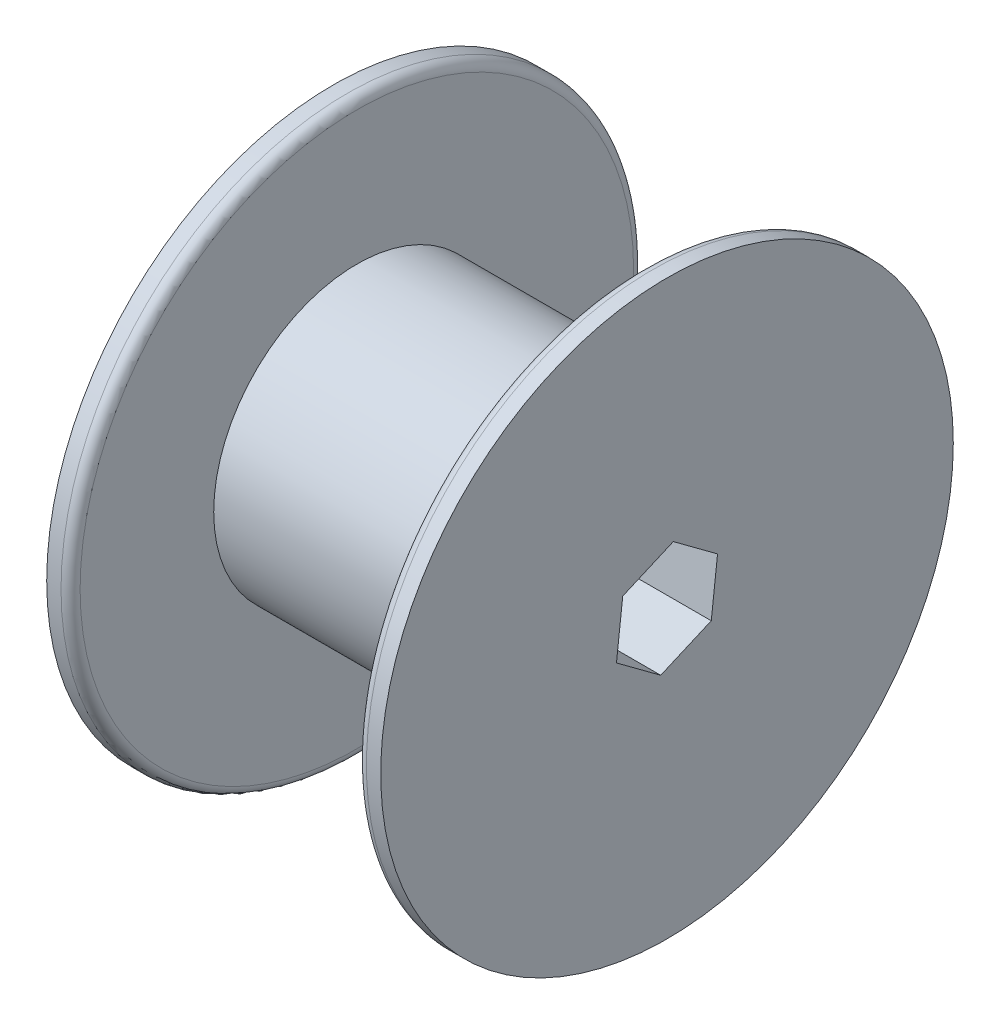
ISO-10303-21;
HEADER;
FILE_DESCRIPTION(('STEP AP214'),'2;1');
FILE_NAME('part.step','',(''),(''),'','','');
FILE_SCHEMA(('AUTOMOTIVE_DESIGN { 1 0 10303 214 1 1 1 1 }'));
ENDSEC;
DATA;
#1=APPLICATION_CONTEXT('core data for automotive mechanical design processes');
#2=APPLICATION_PROTOCOL_DEFINITION('international standard','automotive_design',2000,#1);
#3=PRODUCT_CONTEXT('',#1,'mechanical');
#4=PRODUCT('Part','Part','',(#3));
#5=PRODUCT_RELATED_PRODUCT_CATEGORY('part','',(#4));
#6=PRODUCT_DEFINITION_FORMATION('','',#4);
#7=PRODUCT_DEFINITION_CONTEXT('part definition',#1,'design');
#8=PRODUCT_DEFINITION('design','',#6,#7);
#9=PRODUCT_DEFINITION_SHAPE('','',#8);
#10=(LENGTH_UNIT() NAMED_UNIT(*) SI_UNIT(.MILLI.,.METRE.));
#11=(NAMED_UNIT(*) PLANE_ANGLE_UNIT() SI_UNIT($,.RADIAN.));
#12=(NAMED_UNIT(*) SI_UNIT($,.STERADIAN.) SOLID_ANGLE_UNIT());
#13=UNCERTAINTY_MEASURE_WITH_UNIT(LENGTH_MEASURE(1.E-05),#10,'distance_accuracy_value','');
#14=(GEOMETRIC_REPRESENTATION_CONTEXT(3) GLOBAL_UNCERTAINTY_ASSIGNED_CONTEXT((#13)) GLOBAL_UNIT_ASSIGNED_CONTEXT((#10,
#11,#12)) REPRESENTATION_CONTEXT('',''));
#15=CARTESIAN_POINT('',(0.,0.,0.));
#16=DIRECTION('',(0.,0.,1.));
#17=DIRECTION('',(1.,0.,0.));
#18=AXIS2_PLACEMENT_3D('',#15,#16,#17);
#19=CARTESIAN_POINT('',(38.1,0.,0.));
#20=DIRECTION('',(-1.,0.,0.));
#21=DIRECTION('',(0.,0.,1.));
#22=AXIS2_PLACEMENT_3D('',#19,#20,#21);
#23=CYLINDRICAL_SURFACE('',#22,19.05);
#24=CARTESIAN_POINT('',(38.1,0.,0.));
#25=DIRECTION('',(1.,0.,0.));
#26=DIRECTION('',(0.,0.,-1.));
#27=AXIS2_PLACEMENT_3D('',#24,#25,#26);
#28=CIRCLE('',#27,19.05);
#29=CARTESIAN_POINT('',(38.1,0.,-19.05));
#30=VERTEX_POINT('',#29);
#31=EDGE_CURVE('E188',#30,#30,#28,.T.);
#32=ORIENTED_EDGE('',*,*,#31,.F.);
#33=EDGE_LOOP('',(#32));
#34=FACE_BOUND('',#33,.T.);
#35=CARTESIAN_POINT('',(0.,0.,0.));
#36=DIRECTION('',(1.,0.,0.));
#37=DIRECTION('',(0.,0.,-1.));
#38=AXIS2_PLACEMENT_3D('',#35,#36,#37);
#39=CIRCLE('',#38,19.05);
#40=CARTESIAN_POINT('',(0.,0.,-19.05));
#41=VERTEX_POINT('',#40);
#42=EDGE_CURVE('E187',#41,#41,#39,.T.);
#43=ORIENTED_EDGE('',*,*,#42,.T.);
#44=EDGE_LOOP('',(#43));
#45=FACE_BOUND('',#44,.T.);
#46=ADVANCED_FACE('F38',(#34,#45),#23,.T.);
#47=CARTESIAN_POINT('',(-3.175,0.,0.));
#48=DIRECTION('',(1.,0.,0.));
#49=DIRECTION('',(0.,0.,-1.));
#50=AXIS2_PLACEMENT_3D('',#47,#48,#49);
#51=CYLINDRICAL_SURFACE('',#50,38.1);
#52=CARTESIAN_POINT('',(-1.27,0.,0.));
#53=DIRECTION('',(-1.,0.,0.));
#54=DIRECTION('',(0.,0.,1.));
#55=AXIS2_PLACEMENT_3D('',#52,#53,#54);
#56=CIRCLE('',#55,38.1);
#57=CARTESIAN_POINT('',(-1.27,0.,38.1));
#58=VERTEX_POINT('',#57);
#59=EDGE_CURVE('E192',#58,#58,#56,.T.);
#60=ORIENTED_EDGE('',*,*,#59,.T.);
#61=EDGE_LOOP('',(#60));
#62=FACE_BOUND('',#61,.T.);
#63=CARTESIAN_POINT('',(-3.175,0.,0.));
#64=DIRECTION('',(-1.,0.,0.));
#65=DIRECTION('',(0.,0.,1.));
#66=AXIS2_PLACEMENT_3D('',#63,#64,#65);
#67=CIRCLE('',#66,38.1);
#68=CARTESIAN_POINT('',(-3.175,0.,38.1));
#69=VERTEX_POINT('',#68);
#70=EDGE_CURVE('E183',#69,#69,#67,.T.);
#71=ORIENTED_EDGE('',*,*,#70,.F.);
#72=EDGE_LOOP('',(#71));
#73=FACE_BOUND('',#72,.T.);
#74=ADVANCED_FACE('F223',(#62,#73),#51,.T.);
#75=CARTESIAN_POINT('',(-3.175,0.,0.));
#76=DIRECTION('',(-1.,0.,0.));
#77=DIRECTION('',(0.,0.,1.));
#78=AXIS2_PLACEMENT_3D('',#75,#76,#77);
#79=PLANE('',#78);
#80=DIRECTION('',(0.,0.397948787548919,-0.917407631583881));
#81=VECTOR('',#80,1.);
#82=CARTESIAN_POINT('',(-3.175,4.36658887900208,5.89035099931313));
#83=LINE('',#82,#81);
#84=CARTESIAN_POINT('',(-3.175,4.36658887900208,5.89035099931313));
#85=VERTEX_POINT('',#84);
#86=CARTESIAN_POINT('',(-3.175,7.28448804211327,-0.836401397441846));
#87=VERTEX_POINT('',#86);
#88=EDGE_CURVE('E161',#85,#87,#83,.T.);
#89=ORIENTED_EDGE('',*,*,#88,.F.);
#90=DIRECTION('',(0.,0.993472708351815,-0.11407005636936));
#91=VECTOR('',#90,1.);
#92=CARTESIAN_POINT('',(-3.175,-2.9178991631112,6.72675239675497));
#93=LINE('',#92,#91);
#94=CARTESIAN_POINT('',(-3.175,-2.9178991631112,6.72675239675497));
#95=VERTEX_POINT('',#94);
#96=EDGE_CURVE('E132',#95,#85,#93,.T.);
#97=ORIENTED_EDGE('',*,*,#96,.F.);
#98=DIRECTION('',(0.,0.595523920802897,0.803337575214521));
#99=VECTOR('',#98,1.);
#100=CARTESIAN_POINT('',(-3.175,-7.28448804211327,0.836401397441842));
#101=LINE('',#100,#99);
#102=CARTESIAN_POINT('',(-3.175,-7.28448804211327,0.836401397441842));
#103=VERTEX_POINT('',#102);
#104=EDGE_CURVE('E155',#103,#95,#101,.T.);
#105=ORIENTED_EDGE('',*,*,#104,.F.);
#106=DIRECTION('',(0.,-0.397948787548919,0.917407631583881));
#107=VECTOR('',#106,1.);
#108=CARTESIAN_POINT('',(-3.175,-4.36658887900208,-5.89035099931314));
#109=LINE('',#108,#107);
#110=CARTESIAN_POINT('',(-3.175,-4.36658887900208,-5.89035099931314));
#111=VERTEX_POINT('',#110);
#112=EDGE_CURVE('E152',#111,#103,#109,.T.);
#113=ORIENTED_EDGE('',*,*,#112,.F.);
#114=DIRECTION('',(0.,-0.993472708351815,0.114070056369361));
#115=VECTOR('',#114,1.);
#116=CARTESIAN_POINT('',(-3.175,2.9178991631112,-6.72675239675498));
#117=LINE('',#116,#115);
#118=CARTESIAN_POINT('',(-3.175,2.9178991631112,-6.72675239675498));
#119=VERTEX_POINT('',#118);
#120=EDGE_CURVE('E92',#119,#111,#117,.T.);
#121=ORIENTED_EDGE('',*,*,#120,.F.);
#122=DIRECTION('',(0.,-0.595523920802897,-0.80333757521452));
#123=VECTOR('',#122,1.);
#124=CARTESIAN_POINT('',(-3.175,7.28448804211327,-0.836401397441846));
#125=LINE('',#124,#123);
#126=EDGE_CURVE('E86',#87,#119,#125,.T.);
#127=ORIENTED_EDGE('',*,*,#126,.F.);
#128=EDGE_LOOP('',(#89,#97,#105,#113,#121,#127));
#129=FACE_BOUND('',#128,.T.);
#130=ORIENTED_EDGE('',*,*,#70,.T.);
#131=EDGE_LOOP('',(#130));
#132=FACE_BOUND('',#131,.T.);
#133=ADVANCED_FACE('F229',(#129,#132),#79,.T.);
#134=CARTESIAN_POINT('',(0.,0.,0.));
#135=DIRECTION('',(-1.,0.,0.));
#136=DIRECTION('',(0.,0.,1.));
#137=AXIS2_PLACEMENT_3D('',#134,#135,#136);
#138=PLANE('',#137);
#139=CARTESIAN_POINT('',(0.,0.,0.));
#140=DIRECTION('',(-1.,0.,0.));
#141=DIRECTION('',(0.,0.,1.));
#142=AXIS2_PLACEMENT_3D('',#139,#140,#141);
#143=CIRCLE('',#142,36.83);
#144=CARTESIAN_POINT('',(0.,0.,36.83));
#145=VERTEX_POINT('',#144);
#146=EDGE_CURVE('E199',#145,#145,#143,.F.);
#147=ORIENTED_EDGE('',*,*,#146,.T.);
#148=EDGE_LOOP('',(#147));
#149=FACE_BOUND('',#148,.T.);
#150=ORIENTED_EDGE('',*,*,#42,.F.);
#151=EDGE_LOOP('',(#150));
#152=FACE_BOUND('',#151,.T.);
#153=ADVANCED_FACE('F235',(#149,#152),#138,.F.);
#154=CARTESIAN_POINT('',(41.275,0.,0.));
#155=DIRECTION('',(-1.,0.,0.));
#156=DIRECTION('',(0.,0.,1.));
#157=AXIS2_PLACEMENT_3D('',#154,#155,#156);
#158=CYLINDRICAL_SURFACE('',#157,38.1);
#159=CARTESIAN_POINT('',(39.37,0.,0.));
#160=DIRECTION('',(1.,0.,0.));
#161=DIRECTION('',(0.,0.,-1.));
#162=AXIS2_PLACEMENT_3D('',#159,#160,#161);
#163=CIRCLE('',#162,38.1);
#164=CARTESIAN_POINT('',(39.37,0.,-38.1));
#165=VERTEX_POINT('',#164);
#166=EDGE_CURVE('E48',#165,#165,#163,.T.);
#167=ORIENTED_EDGE('',*,*,#166,.T.);
#168=EDGE_LOOP('',(#167));
#169=FACE_BOUND('',#168,.T.);
#170=CARTESIAN_POINT('',(41.275,0.,0.));
#171=DIRECTION('',(1.,0.,0.));
#172=DIRECTION('',(0.,0.,-1.));
#173=AXIS2_PLACEMENT_3D('',#170,#171,#172);
#174=CIRCLE('',#173,38.1);
#175=CARTESIAN_POINT('',(41.275,0.,-38.1));
#176=VERTEX_POINT('',#175);
#177=EDGE_CURVE('E169',#176,#176,#174,.T.);
#178=ORIENTED_EDGE('',*,*,#177,.F.);
#179=EDGE_LOOP('',(#178));
#180=FACE_BOUND('',#179,.T.);
#181=ADVANCED_FACE('F206',(#169,#180),#158,.T.);
#182=CARTESIAN_POINT('',(41.275,0.,0.));
#183=DIRECTION('',(1.,0.,0.));
#184=DIRECTION('',(0.,0.,-1.));
#185=AXIS2_PLACEMENT_3D('',#182,#183,#184);
#186=PLANE('',#185);
#187=DIRECTION('',(0.,-0.993472708351815,0.114070056369361));
#188=VECTOR('',#187,1.);
#189=CARTESIAN_POINT('',(41.275,2.9178991631112,-6.72675239675498));
#190=LINE('',#189,#188);
#191=CARTESIAN_POINT('',(41.275,2.9178991631112,-6.72675239675498));
#192=VERTEX_POINT('',#191);
#193=CARTESIAN_POINT('',(41.275,-4.36658887900208,-5.89035099931314));
#194=VERTEX_POINT('',#193);
#195=EDGE_CURVE('E58',#192,#194,#190,.T.);
#196=ORIENTED_EDGE('',*,*,#195,.T.);
#197=DIRECTION('',(0.,-0.397948787548919,0.917407631583881));
#198=VECTOR('',#197,1.);
#199=CARTESIAN_POINT('',(41.275,-4.36658887900208,-5.89035099931314));
#200=LINE('',#199,#198);
#201=CARTESIAN_POINT('',(41.275,-7.28448804211327,0.836401397441842));
#202=VERTEX_POINT('',#201);
#203=EDGE_CURVE('E102',#194,#202,#200,.T.);
#204=ORIENTED_EDGE('',*,*,#203,.T.);
#205=DIRECTION('',(0.,0.595523920802897,0.803337575214521));
#206=VECTOR('',#205,1.);
#207=CARTESIAN_POINT('',(41.275,-7.28448804211327,0.836401397441842));
#208=LINE('',#207,#206);
#209=CARTESIAN_POINT('',(41.275,-2.9178991631112,6.72675239675497));
#210=VERTEX_POINT('',#209);
#211=EDGE_CURVE('E139',#202,#210,#208,.T.);
#212=ORIENTED_EDGE('',*,*,#211,.T.);
#213=DIRECTION('',(0.,0.993472708351815,-0.11407005636936));
#214=VECTOR('',#213,1.);
#215=CARTESIAN_POINT('',(41.275,-2.9178991631112,6.72675239675497));
#216=LINE('',#215,#214);
#217=CARTESIAN_POINT('',(41.275,4.36658887900208,5.89035099931313));
#218=VERTEX_POINT('',#217);
#219=EDGE_CURVE('E125',#210,#218,#216,.T.);
#220=ORIENTED_EDGE('',*,*,#219,.T.);
#221=DIRECTION('',(0.,0.397948787548919,-0.917407631583881));
#222=VECTOR('',#221,1.);
#223=CARTESIAN_POINT('',(41.275,4.36658887900208,5.89035099931313));
#224=LINE('',#223,#222);
#225=CARTESIAN_POINT('',(41.275,7.28448804211327,-0.836401397441846));
#226=VERTEX_POINT('',#225);
#227=EDGE_CURVE('E114',#218,#226,#224,.T.);
#228=ORIENTED_EDGE('',*,*,#227,.T.);
#229=DIRECTION('',(0.,-0.595523920802897,-0.80333757521452));
#230=VECTOR('',#229,1.);
#231=CARTESIAN_POINT('',(41.275,7.28448804211327,-0.836401397441846));
#232=LINE('',#231,#230);
#233=EDGE_CURVE('E124',#226,#192,#232,.T.);
#234=ORIENTED_EDGE('',*,*,#233,.T.);
#235=EDGE_LOOP('',(#196,#204,#212,#220,#228,#234));
#236=FACE_BOUND('',#235,.T.);
#237=ORIENTED_EDGE('',*,*,#177,.T.);
#238=EDGE_LOOP('',(#237));
#239=FACE_BOUND('',#238,.T.);
#240=ADVANCED_FACE('F137',(#236,#239),#186,.T.);
#241=CARTESIAN_POINT('',(38.1,0.,0.));
#242=DIRECTION('',(1.,0.,0.));
#243=DIRECTION('',(0.,0.,-1.));
#244=AXIS2_PLACEMENT_3D('',#241,#242,#243);
#245=PLANE('',#244);
#246=CARTESIAN_POINT('',(38.1,0.,0.));
#247=DIRECTION('',(1.,0.,0.));
#248=DIRECTION('',(0.,0.,-1.));
#249=AXIS2_PLACEMENT_3D('',#246,#247,#248);
#250=CIRCLE('',#249,36.83);
#251=CARTESIAN_POINT('',(38.1,0.,-36.83));
#252=VERTEX_POINT('',#251);
#253=EDGE_CURVE('E11',#252,#252,#250,.F.);
#254=ORIENTED_EDGE('',*,*,#253,.T.);
#255=EDGE_LOOP('',(#254));
#256=FACE_BOUND('',#255,.T.);
#257=ORIENTED_EDGE('',*,*,#31,.T.);
#258=EDGE_LOOP('',(#257));
#259=FACE_BOUND('',#258,.T.);
#260=ADVANCED_FACE('F219',(#256,#259),#245,.F.);
#261=CARTESIAN_POINT('',(-1.27,0.,0.));
#262=DIRECTION('',(-1.,0.,0.));
#263=DIRECTION('',(0.,0.,1.));
#264=AXIS2_PLACEMENT_3D('',#261,#262,#263);
#265=TOROIDAL_SURFACE('',#264,36.83,1.27);
#266=ORIENTED_EDGE('',*,*,#146,.F.);
#267=EDGE_LOOP('',(#266));
#268=FACE_BOUND('',#267,.T.);
#269=ORIENTED_EDGE('',*,*,#59,.F.);
#270=EDGE_LOOP('',(#269));
#271=FACE_BOUND('',#270,.T.);
#272=ADVANCED_FACE('F211',(#268,#271),#265,.T.);
#273=CARTESIAN_POINT('',(39.37,0.,0.));
#274=DIRECTION('',(1.,0.,0.));
#275=DIRECTION('',(0.,0.,-1.));
#276=AXIS2_PLACEMENT_3D('',#273,#274,#275);
#277=TOROIDAL_SURFACE('',#276,36.83,1.27);
#278=ORIENTED_EDGE('',*,*,#253,.F.);
#279=EDGE_LOOP('',(#278));
#280=FACE_BOUND('',#279,.T.);
#281=ORIENTED_EDGE('',*,*,#166,.F.);
#282=EDGE_LOOP('',(#281));
#283=FACE_BOUND('',#282,.T.);
#284=ADVANCED_FACE('F40',(#280,#283),#277,.T.);
#285=CARTESIAN_POINT('',(41.275,2.9178991631112,-6.72675239675498));
#286=DIRECTION('',(0.,-0.114070056369361,-0.993472708351815));
#287=DIRECTION('',(0.,0.993472708351815,-0.114070056369361));
#288=AXIS2_PLACEMENT_3D('',#285,#286,#287);
#289=PLANE('',#288);
#290=ORIENTED_EDGE('',*,*,#120,.T.);
#291=DIRECTION('',(-1.,0.,0.));
#292=VECTOR('',#291,1.);
#293=CARTESIAN_POINT('',(41.275,-4.36658887900208,-5.89035099931314));
#294=LINE('',#293,#292);
#295=EDGE_CURVE('E149',#194,#111,#294,.T.);
#296=ORIENTED_EDGE('',*,*,#295,.F.);
#297=ORIENTED_EDGE('',*,*,#195,.F.);
#298=DIRECTION('',(-1.,0.,0.));
#299=VECTOR('',#298,1.);
#300=CARTESIAN_POINT('',(41.275,2.9178991631112,-6.72675239675498));
#301=LINE('',#300,#299);
#302=EDGE_CURVE('E166',#192,#119,#301,.T.);
#303=ORIENTED_EDGE('',*,*,#302,.T.);
#304=EDGE_LOOP('',(#290,#296,#297,#303));
#305=FACE_BOUND('',#304,.T.);
#306=ADVANCED_FACE('F210',(#305),#289,.F.);
#307=CARTESIAN_POINT('',(41.275,7.28448804211327,-0.836401397441846));
#308=DIRECTION('',(0.,0.80333757521452,-0.595523920802897));
#309=DIRECTION('',(0.,0.595523920802897,0.80333757521452));
#310=AXIS2_PLACEMENT_3D('',#307,#308,#309);
#311=PLANE('',#310);
#312=ORIENTED_EDGE('',*,*,#126,.T.);
#313=ORIENTED_EDGE('',*,*,#302,.F.);
#314=ORIENTED_EDGE('',*,*,#233,.F.);
#315=DIRECTION('',(-1.,0.,0.));
#316=VECTOR('',#315,1.);
#317=CARTESIAN_POINT('',(41.275,7.28448804211327,-0.836401397441846));
#318=LINE('',#317,#316);
#319=EDGE_CURVE('E119',#226,#87,#318,.T.);
#320=ORIENTED_EDGE('',*,*,#319,.T.);
#321=EDGE_LOOP('',(#312,#313,#314,#320));
#322=FACE_BOUND('',#321,.T.);
#323=ADVANCED_FACE('F217',(#322),#311,.F.);
#324=CARTESIAN_POINT('',(41.275,4.36658887900208,5.89035099931313));
#325=DIRECTION('',(0.,0.917407631583881,0.397948787548919));
#326=DIRECTION('',(0.,-0.397948787548919,0.917407631583881));
#327=AXIS2_PLACEMENT_3D('',#324,#325,#326);
#328=PLANE('',#327);
#329=ORIENTED_EDGE('',*,*,#88,.T.);
#330=ORIENTED_EDGE('',*,*,#319,.F.);
#331=ORIENTED_EDGE('',*,*,#227,.F.);
#332=DIRECTION('',(-1.,0.,0.));
#333=VECTOR('',#332,1.);
#334=CARTESIAN_POINT('',(41.275,4.36658887900208,5.89035099931313));
#335=LINE('',#334,#333);
#336=EDGE_CURVE('E117',#218,#85,#335,.T.);
#337=ORIENTED_EDGE('',*,*,#336,.T.);
#338=EDGE_LOOP('',(#329,#330,#331,#337));
#339=FACE_BOUND('',#338,.T.);
#340=ADVANCED_FACE('F116',(#339),#328,.F.);
#341=CARTESIAN_POINT('',(41.275,-2.9178991631112,6.72675239675497));
#342=DIRECTION('',(0.,0.11407005636936,0.993472708351815));
#343=DIRECTION('',(0.,-0.993472708351815,0.11407005636936));
#344=AXIS2_PLACEMENT_3D('',#341,#342,#343);
#345=PLANE('',#344);
#346=ORIENTED_EDGE('',*,*,#96,.T.);
#347=ORIENTED_EDGE('',*,*,#336,.F.);
#348=ORIENTED_EDGE('',*,*,#219,.F.);
#349=DIRECTION('',(-1.,0.,0.));
#350=VECTOR('',#349,1.);
#351=CARTESIAN_POINT('',(41.275,-2.9178991631112,6.72675239675497));
#352=LINE('',#351,#350);
#353=EDGE_CURVE('E134',#210,#95,#352,.T.);
#354=ORIENTED_EDGE('',*,*,#353,.T.);
#355=EDGE_LOOP('',(#346,#347,#348,#354));
#356=FACE_BOUND('',#355,.T.);
#357=ADVANCED_FACE('F129',(#356),#345,.F.);
#358=CARTESIAN_POINT('',(41.275,-7.28448804211327,0.836401397441842));
#359=DIRECTION('',(0.,-0.803337575214521,0.595523920802897));
#360=DIRECTION('',(0.,-0.595523920802897,-0.803337575214521));
#361=AXIS2_PLACEMENT_3D('',#358,#359,#360);
#362=PLANE('',#361);
#363=ORIENTED_EDGE('',*,*,#104,.T.);
#364=ORIENTED_EDGE('',*,*,#353,.F.);
#365=ORIENTED_EDGE('',*,*,#211,.F.);
#366=DIRECTION('',(-1.,0.,0.));
#367=VECTOR('',#366,1.);
#368=CARTESIAN_POINT('',(41.275,-7.28448804211327,0.836401397441842));
#369=LINE('',#368,#367);
#370=EDGE_CURVE('E174',#202,#103,#369,.T.);
#371=ORIENTED_EDGE('',*,*,#370,.T.);
#372=EDGE_LOOP('',(#363,#364,#365,#371));
#373=FACE_BOUND('',#372,.T.);
#374=ADVANCED_FACE('F251',(#373),#362,.F.);
#375=CARTESIAN_POINT('',(41.275,-4.36658887900208,-5.89035099931314));
#376=DIRECTION('',(0.,-0.917407631583881,-0.397948787548919));
#377=DIRECTION('',(0.,0.397948787548919,-0.917407631583881));
#378=AXIS2_PLACEMENT_3D('',#375,#376,#377);
#379=PLANE('',#378);
#380=ORIENTED_EDGE('',*,*,#112,.T.);
#381=ORIENTED_EDGE('',*,*,#370,.F.);
#382=ORIENTED_EDGE('',*,*,#203,.F.);
#383=ORIENTED_EDGE('',*,*,#295,.T.);
#384=EDGE_LOOP('',(#380,#381,#382,#383));
#385=FACE_BOUND('',#384,.T.);
#386=ADVANCED_FACE('F248',(#385),#379,.F.);
#387=CLOSED_SHELL('',(#46,#74,#133,#153,#181,#240,#260,#272,#284,#306,#323,#340,#357,#374,#386));
#388=MANIFOLD_SOLID_BREP('B2',#387);
#389=ADVANCED_BREP_SHAPE_REPRESENTATION('',(#18,#388),#14);
#390=SHAPE_DEFINITION_REPRESENTATION(#9,#389);
ENDSEC;
END-ISO-10303-21;
